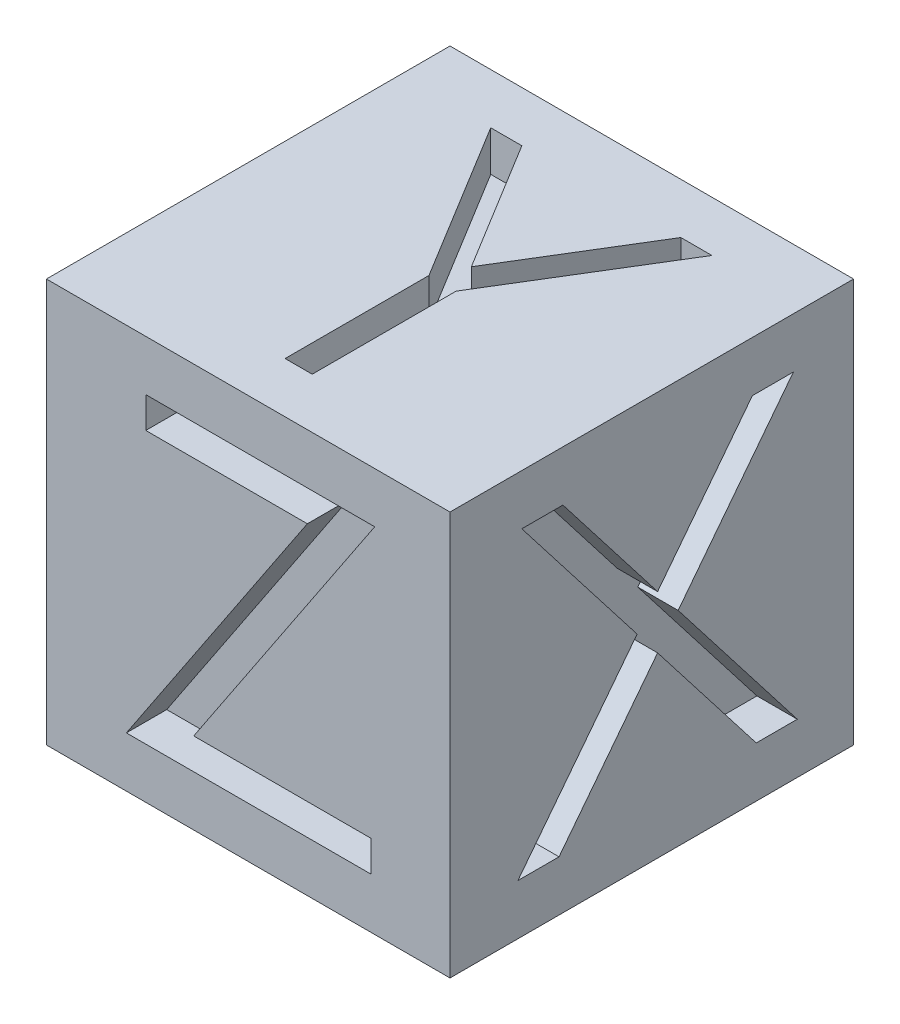
ISO-10303-21;
HEADER;
FILE_DESCRIPTION(('STEP AP214'),'2;1');
FILE_NAME('part.step','',(''),(''),'','','');
FILE_SCHEMA(('AUTOMOTIVE_DESIGN { 1 0 10303 214 1 1 1 1 }'));
ENDSEC;
DATA;
#1=APPLICATION_CONTEXT('core data for automotive mechanical design processes');
#2=APPLICATION_PROTOCOL_DEFINITION('international standard','automotive_design',2000,#1);
#3=PRODUCT_CONTEXT('',#1,'mechanical');
#4=PRODUCT('Part','Part','',(#3));
#5=PRODUCT_RELATED_PRODUCT_CATEGORY('part','',(#4));
#6=PRODUCT_DEFINITION_FORMATION('','',#4);
#7=PRODUCT_DEFINITION_CONTEXT('part definition',#1,'design');
#8=PRODUCT_DEFINITION('design','',#6,#7);
#9=PRODUCT_DEFINITION_SHAPE('','',#8);
#10=(LENGTH_UNIT() NAMED_UNIT(*) SI_UNIT(.MILLI.,.METRE.));
#11=(NAMED_UNIT(*) PLANE_ANGLE_UNIT() SI_UNIT($,.RADIAN.));
#12=(NAMED_UNIT(*) SI_UNIT($,.STERADIAN.) SOLID_ANGLE_UNIT());
#13=UNCERTAINTY_MEASURE_WITH_UNIT(LENGTH_MEASURE(1.E-05),#10,'distance_accuracy_value','');
#14=(GEOMETRIC_REPRESENTATION_CONTEXT(3) GLOBAL_UNCERTAINTY_ASSIGNED_CONTEXT((#13)) GLOBAL_UNIT_ASSIGNED_CONTEXT((#10,
#11,#12)) REPRESENTATION_CONTEXT('',''));
#15=CARTESIAN_POINT('',(0.,0.,0.));
#16=DIRECTION('',(0.,0.,1.));
#17=DIRECTION('',(1.,0.,0.));
#18=AXIS2_PLACEMENT_3D('',#15,#16,#17);
#19=CARTESIAN_POINT('',(0.,20.,0.));
#20=DIRECTION('',(0.,1.,0.));
#21=DIRECTION('',(0.,0.,1.));
#22=AXIS2_PLACEMENT_3D('',#19,#20,#21);
#23=PLANE('',#22);
#24=DIRECTION('',(0.,0.,1.));
#25=VECTOR('',#24,1.);
#26=CARTESIAN_POINT('',(-10.,20.,10.));
#27=LINE('',#26,#25);
#28=CARTESIAN_POINT('',(-10.,20.,-10.));
#29=VERTEX_POINT('',#28);
#30=CARTESIAN_POINT('',(-10.,20.,10.));
#31=VERTEX_POINT('',#30);
#32=EDGE_CURVE('E490',#29,#31,#27,.T.);
#33=ORIENTED_EDGE('',*,*,#32,.T.);
#34=DIRECTION('',(1.,0.,0.));
#35=VECTOR('',#34,1.);
#36=CARTESIAN_POINT('',(10.,20.,10.));
#37=LINE('',#36,#35);
#38=CARTESIAN_POINT('',(10.,20.,10.));
#39=VERTEX_POINT('',#38);
#40=EDGE_CURVE('E494',#31,#39,#37,.T.);
#41=ORIENTED_EDGE('',*,*,#40,.T.);
#42=DIRECTION('',(0.,0.,-1.));
#43=VECTOR('',#42,1.);
#44=CARTESIAN_POINT('',(10.,20.,10.));
#45=LINE('',#44,#43);
#46=CARTESIAN_POINT('',(10.,20.,-10.));
#47=VERTEX_POINT('',#46);
#48=EDGE_CURVE('E498',#39,#47,#45,.T.);
#49=ORIENTED_EDGE('',*,*,#48,.T.);
#50=DIRECTION('',(-1.,0.,0.));
#51=VECTOR('',#50,1.);
#52=CARTESIAN_POINT('',(10.,20.,-10.));
#53=LINE('',#52,#51);
#54=EDGE_CURVE('E501',#47,#29,#53,.T.);
#55=ORIENTED_EDGE('',*,*,#54,.T.);
#56=EDGE_LOOP('',(#33,#41,#49,#55));
#57=FACE_BOUND('',#56,.T.);
#58=DIRECTION('',(0.,0.,-1.));
#59=VECTOR('',#58,1.);
#60=CARTESIAN_POINT('',(-0.673076923076924,20.,7.5));
#61=LINE('',#60,#59);
#62=CARTESIAN_POINT('',(-0.673076923076924,20.,7.5));
#63=VERTEX_POINT('',#62);
#64=CARTESIAN_POINT('',(-0.673076923076924,20.,0.369591346153846));
#65=VERTEX_POINT('',#64);
#66=EDGE_CURVE('E274',#63,#65,#61,.T.);
#67=ORIENTED_EDGE('',*,*,#66,.T.);
#68=DIRECTION('',(-0.521331386880887,0.,-0.853354313900651));
#69=VECTOR('',#68,1.);
#70=CARTESIAN_POINT('',(-0.673076923076924,20.,0.369591346153846));
#71=LINE('',#70,#69);
#72=CARTESIAN_POINT('',(-5.48076923076923,20.,-7.5));
#73=VERTEX_POINT('',#72);
#74=EDGE_CURVE('E54',#65,#73,#71,.T.);
#75=ORIENTED_EDGE('',*,*,#74,.T.);
#76=DIRECTION('',(1.,0.,0.));
#77=VECTOR('',#76,1.);
#78=CARTESIAN_POINT('',(-5.48076923076923,20.,-7.5));
#79=LINE('',#78,#77);
#80=CARTESIAN_POINT('',(-3.93930288461539,20.,-7.5));
#81=VERTEX_POINT('',#80);
#82=EDGE_CURVE('E278',#73,#81,#79,.T.);
#83=ORIENTED_EDGE('',*,*,#82,.T.);
#84=DIRECTION('',(0.521787793651245,0.,0.853075318126463));
#85=VECTOR('',#84,1.);
#86=CARTESIAN_POINT('',(-3.93930288461539,20.,-7.5));
#87=LINE('',#86,#85);
#88=CARTESIAN_POINT('',(0.00300480769230716,20.,-1.0546875));
#89=VERTEX_POINT('',#88);
#90=EDGE_CURVE('E969',#81,#89,#87,.T.);
#91=ORIENTED_EDGE('',*,*,#90,.T.);
#92=DIRECTION('',(0.521208584832579,0.,-0.853429324019757));
#93=VECTOR('',#92,1.);
#94=CARTESIAN_POINT('',(0.00300480769230716,20.,-1.0546875));
#95=LINE('',#94,#93);
#96=CARTESIAN_POINT('',(3.93930288461539,20.,-7.5));
#97=VERTEX_POINT('',#96);
#98=EDGE_CURVE('E971',#89,#97,#95,.T.);
#99=ORIENTED_EDGE('',*,*,#98,.T.);
#100=DIRECTION('',(1.,0.,0.));
#101=VECTOR('',#100,1.);
#102=CARTESIAN_POINT('',(3.93930288461539,20.,-7.5));
#103=LINE('',#102,#101);
#104=CARTESIAN_POINT('',(5.48076923076923,20.,-7.5));
#105=VERTEX_POINT('',#104);
#106=EDGE_CURVE('E976',#97,#105,#103,.T.);
#107=ORIENTED_EDGE('',*,*,#106,.T.);
#108=DIRECTION('',(-0.521331386880887,0.,0.853354313900651));
#109=VECTOR('',#108,1.);
#110=CARTESIAN_POINT('',(5.48076923076923,20.,-7.5));
#111=LINE('',#110,#109);
#112=CARTESIAN_POINT('',(0.673076923076923,20.,0.369591346153846));
#113=VERTEX_POINT('',#112);
#114=EDGE_CURVE('E944',#105,#113,#111,.T.);
#115=ORIENTED_EDGE('',*,*,#114,.T.);
#116=DIRECTION('',(0.,0.,1.));
#117=VECTOR('',#116,1.);
#118=CARTESIAN_POINT('',(0.673076923076923,20.,0.369591346153846));
#119=LINE('',#118,#117);
#120=CARTESIAN_POINT('',(0.673076923076923,20.,7.5));
#121=VERTEX_POINT('',#120);
#122=EDGE_CURVE('E939',#113,#121,#119,.T.);
#123=ORIENTED_EDGE('',*,*,#122,.T.);
#124=DIRECTION('',(-1.,0.,0.));
#125=VECTOR('',#124,1.);
#126=CARTESIAN_POINT('',(0.673076923076923,20.,7.5));
#127=LINE('',#126,#125);
#128=EDGE_CURVE('E933',#121,#63,#127,.T.);
#129=ORIENTED_EDGE('',*,*,#128,.T.);
#130=EDGE_LOOP('',(#67,#75,#83,#91,#99,#107,#115,#123,#129));
#131=FACE_BOUND('',#130,.T.);
#132=ADVANCED_FACE('F38',(#57,#131),#23,.T.);
#133=CARTESIAN_POINT('',(10.,20.,10.));
#134=DIRECTION('',(-1.,0.,0.));
#135=DIRECTION('',(0.,0.,1.));
#136=AXIS2_PLACEMENT_3D('',#133,#134,#135);
#137=PLANE('',#136);
#138=DIRECTION('',(0.,0.,-1.));
#139=VECTOR('',#138,1.);
#140=CARTESIAN_POINT('',(10.,0.,10.));
#141=LINE('',#140,#139);
#142=CARTESIAN_POINT('',(10.,0.,10.));
#143=VERTEX_POINT('',#142);
#144=CARTESIAN_POINT('',(10.,0.,-10.));
#145=VERTEX_POINT('',#144);
#146=EDGE_CURVE('E511',#143,#145,#141,.T.);
#147=ORIENTED_EDGE('',*,*,#146,.T.);
#148=DIRECTION('',(0.,-1.,0.));
#149=VECTOR('',#148,1.);
#150=CARTESIAN_POINT('',(10.,20.,-10.));
#151=LINE('',#150,#149);
#152=EDGE_CURVE('E519',#47,#145,#151,.T.);
#153=ORIENTED_EDGE('',*,*,#152,.F.);
#154=ORIENTED_EDGE('',*,*,#48,.F.);
#155=DIRECTION('',(0.,-1.,0.));
#156=VECTOR('',#155,1.);
#157=CARTESIAN_POINT('',(10.,20.,10.));
#158=LINE('',#157,#156);
#159=EDGE_CURVE('E47',#39,#143,#158,.T.);
#160=ORIENTED_EDGE('',*,*,#159,.T.);
#161=EDGE_LOOP('',(#147,#153,#154,#160));
#162=FACE_BOUND('',#161,.T.);
#163=DIRECTION('',(0.,0.790512484886621,0.612445925154523));
#164=VECTOR('',#163,1.);
#165=CARTESIAN_POINT('',(10.,10.1231971153846,0.727163461538461));
#166=LINE('',#165,#164);
#167=CARTESIAN_POINT('',(10.,10.1231971153846,0.727163461538462));
#168=VERTEX_POINT('',#167);
#169=CARTESIAN_POINT('',(10.,17.5,6.44230769230769));
#170=VERTEX_POINT('',#169);
#171=EDGE_CURVE('E62',#168,#170,#166,.T.);
#172=ORIENTED_EDGE('',*,*,#171,.T.);
#173=DIRECTION('',(0.,0.,-1.));
#174=VECTOR('',#173,1.);
#175=CARTESIAN_POINT('',(10.,17.5,6.44230769230769));
#176=LINE('',#175,#174);
#177=CARTESIAN_POINT('',(10.,17.5,4.40504807692308));
#178=VERTEX_POINT('',#177);
#179=EDGE_CURVE('E284',#170,#178,#176,.T.);
#180=ORIENTED_EDGE('',*,*,#179,.T.);
#181=DIRECTION('',(0.,-0.790638008474675,-0.612283871709193));
#182=VECTOR('',#181,1.);
#183=CARTESIAN_POINT('',(10.,17.5,4.40504807692308));
#184=LINE('',#183,#182);
#185=CARTESIAN_POINT('',(10.,11.4393028846154,-0.288461538461539));
#186=VERTEX_POINT('',#185);
#187=EDGE_CURVE('E332',#178,#186,#184,.T.);
#188=ORIENTED_EDGE('',*,*,#187,.T.);
#189=DIRECTION('',(0.,0.790448257101086,-0.612528817971739));
#190=VECTOR('',#189,1.);
#191=CARTESIAN_POINT('',(10.,11.4393028846154,-0.288461538461539));
#192=LINE('',#191,#190);
#193=CARTESIAN_POINT('',(10.,17.5,-4.98497596153846));
#194=VERTEX_POINT('',#193);
#195=EDGE_CURVE('E336',#186,#194,#192,.T.);
#196=ORIENTED_EDGE('',*,*,#195,.T.);
#197=DIRECTION('',(0.,0.,-1.));
#198=VECTOR('',#197,1.);
#199=CARTESIAN_POINT('',(10.,17.5,-4.98497596153846));
#200=LINE('',#199,#198);
#201=CARTESIAN_POINT('',(10.,17.5,-7.01923076923077));
#202=VERTEX_POINT('',#201);
#203=EDGE_CURVE('E340',#194,#202,#200,.T.);
#204=ORIENTED_EDGE('',*,*,#203,.T.);
#205=DIRECTION('',(0.,-0.790668385561736,0.612244643972652));
#206=VECTOR('',#205,1.);
#207=CARTESIAN_POINT('',(10.,17.5,-7.01923076923077));
#208=LINE('',#207,#206);
#209=CARTESIAN_POINT('',(10.,10.1231971153846,-1.30709134615385));
#210=VERTEX_POINT('',#209);
#211=EDGE_CURVE('E344',#202,#210,#208,.T.);
#212=ORIENTED_EDGE('',*,*,#211,.T.);
#213=DIRECTION('',(0.,-0.790592308194247,-0.612342879622269));
#214=VECTOR('',#213,1.);
#215=CARTESIAN_POINT('',(10.,10.1231971153846,-1.30709134615385));
#216=LINE('',#215,#214);
#217=CARTESIAN_POINT('',(10.,2.5,-7.21153846153846));
#218=VERTEX_POINT('',#217);
#219=EDGE_CURVE('E348',#210,#218,#216,.T.);
#220=ORIENTED_EDGE('',*,*,#219,.T.);
#221=DIRECTION('',(0.,0.,1.));
#222=VECTOR('',#221,1.);
#223=CARTESIAN_POINT('',(10.,2.5,-7.21153846153846));
#224=LINE('',#223,#222);
#225=CARTESIAN_POINT('',(10.,2.5,-5.17728365384615));
#226=VERTEX_POINT('',#225);
#227=EDGE_CURVE('E352',#218,#226,#224,.T.);
#228=ORIENTED_EDGE('',*,*,#227,.T.);
#229=DIRECTION('',(0.,0.790506174837041,0.612454069742793));
#230=VECTOR('',#229,1.);
#231=CARTESIAN_POINT('',(10.,2.5,-5.17728365384615));
#232=LINE('',#231,#230);
#233=CARTESIAN_POINT('',(10.,8.81009615384616,-0.288461538461539));
#234=VERTEX_POINT('',#233);
#235=EDGE_CURVE('E356',#226,#234,#232,.T.);
#236=ORIENTED_EDGE('',*,*,#235,.T.);
#237=DIRECTION('',(0.,-0.790688430676369,0.612218756323703));
#238=VECTOR('',#237,1.);
#239=CARTESIAN_POINT('',(10.,8.81009615384616,-0.288461538461539));
#240=LINE('',#239,#238);
#241=CARTESIAN_POINT('',(10.,2.5,4.59735576923077));
#242=VERTEX_POINT('',#241);
#243=EDGE_CURVE('E360',#234,#242,#240,.T.);
#244=ORIENTED_EDGE('',*,*,#243,.T.);
#245=DIRECTION('',(0.,0.,1.));
#246=VECTOR('',#245,1.);
#247=CARTESIAN_POINT('',(10.,2.5,4.59735576923077));
#248=LINE('',#247,#246);
#249=CARTESIAN_POINT('',(10.,2.5,6.63461538461539));
#250=VERTEX_POINT('',#249);
#251=EDGE_CURVE('E364',#242,#250,#248,.T.);
#252=ORIENTED_EDGE('',*,*,#251,.T.);
#253=DIRECTION('',(0.,0.790441451165735,-0.612537600706281));
#254=VECTOR('',#253,1.);
#255=CARTESIAN_POINT('',(10.,2.5,6.63461538461539));
#256=LINE('',#255,#254);
#257=EDGE_CURVE('E295',#250,#168,#256,.T.);
#258=ORIENTED_EDGE('',*,*,#257,.T.);
#259=EDGE_LOOP('',(#172,#180,#188,#196,#204,#212,#220,#228,#236,#244,#252,#258));
#260=FACE_BOUND('',#259,.T.);
#261=ADVANCED_FACE('F528',(#162,#260),#137,.F.);
#262=CARTESIAN_POINT('',(10.,20.,10.));
#263=DIRECTION('',(0.,0.,-1.));
#264=DIRECTION('',(-1.,0.,0.));
#265=AXIS2_PLACEMENT_3D('',#262,#263,#264);
#266=PLANE('',#265);
#267=DIRECTION('',(1.,0.,0.));
#268=VECTOR('',#267,1.);
#269=CARTESIAN_POINT('',(10.,0.,10.));
#270=LINE('',#269,#268);
#271=CARTESIAN_POINT('',(-10.,0.,10.));
#272=VERTEX_POINT('',#271);
#273=EDGE_CURVE('E508',#272,#143,#270,.T.);
#274=ORIENTED_EDGE('',*,*,#273,.T.);
#275=ORIENTED_EDGE('',*,*,#159,.F.);
#276=ORIENTED_EDGE('',*,*,#40,.F.);
#277=DIRECTION('',(0.,-1.,0.));
#278=VECTOR('',#277,1.);
#279=CARTESIAN_POINT('',(-10.,20.,10.));
#280=LINE('',#279,#278);
#281=EDGE_CURVE('E11',#31,#272,#280,.T.);
#282=ORIENTED_EDGE('',*,*,#281,.T.);
#283=EDGE_LOOP('',(#274,#275,#276,#282));
#284=FACE_BOUND('',#283,.T.);
#285=DIRECTION('',(-1.,0.,0.));
#286=VECTOR('',#285,1.);
#287=CARTESIAN_POINT('',(2.93088942307692,15.9615384615385,10.));
#288=LINE('',#287,#286);
#289=CARTESIAN_POINT('',(2.93088942307692,15.9615384615385,10.));
#290=VERTEX_POINT('',#289);
#291=CARTESIAN_POINT('',(-5.07692307692308,15.9615384615385,10.));
#292=VERTEX_POINT('',#291);
#293=EDGE_CURVE('E406',#290,#292,#288,.T.);
#294=ORIENTED_EDGE('',*,*,#293,.T.);
#295=DIRECTION('',(0.,1.,0.));
#296=VECTOR('',#295,1.);
#297=CARTESIAN_POINT('',(-5.07692307692308,15.9615384615385,10.));
#298=LINE('',#297,#296);
#299=CARTESIAN_POINT('',(-5.07692307692308,17.5,10.));
#300=VERTEX_POINT('',#299);
#301=EDGE_CURVE('E437',#292,#300,#298,.T.);
#302=ORIENTED_EDGE('',*,*,#301,.T.);
#303=DIRECTION('',(1.,0.,0.));
#304=VECTOR('',#303,1.);
#305=CARTESIAN_POINT('',(-5.07692307692308,17.5,10.));
#306=LINE('',#305,#304);
#307=CARTESIAN_POINT('',(6.26923076923077,17.5,10.));
#308=VERTEX_POINT('',#307);
#309=EDGE_CURVE('E441',#300,#308,#306,.T.);
#310=ORIENTED_EDGE('',*,*,#309,.T.);
#311=DIRECTION('',(-0.55448584235818,-0.832193157040083,0.));
#312=VECTOR('',#311,1.);
#313=CARTESIAN_POINT('',(6.26923076923077,17.5,10.));
#314=LINE('',#313,#312);
#315=CARTESIAN_POINT('',(-2.70012019230769,4.03846153846154,10.));
#316=VERTEX_POINT('',#315);
#317=EDGE_CURVE('E445',#308,#316,#314,.T.);
#318=ORIENTED_EDGE('',*,*,#317,.T.);
#319=DIRECTION('',(1.,0.,0.));
#320=VECTOR('',#319,1.);
#321=CARTESIAN_POINT('',(-2.70012019230769,4.03846153846154,10.));
#322=LINE('',#321,#320);
#323=CARTESIAN_POINT('',(6.07692307692308,4.03846153846154,10.));
#324=VERTEX_POINT('',#323);
#325=EDGE_CURVE('E449',#316,#324,#322,.T.);
#326=ORIENTED_EDGE('',*,*,#325,.T.);
#327=DIRECTION('',(0.,-1.,0.));
#328=VECTOR('',#327,1.);
#329=CARTESIAN_POINT('',(6.07692307692308,4.03846153846154,10.));
#330=LINE('',#329,#328);
#331=CARTESIAN_POINT('',(6.07692307692308,2.5,10.));
#332=VERTEX_POINT('',#331);
#333=EDGE_CURVE('E453',#324,#332,#330,.T.);
#334=ORIENTED_EDGE('',*,*,#333,.T.);
#335=DIRECTION('',(-1.,0.,0.));
#336=VECTOR('',#335,1.);
#337=CARTESIAN_POINT('',(6.07692307692308,2.5,10.));
#338=LINE('',#337,#336);
#339=CARTESIAN_POINT('',(-6.03846153846154,2.5,10.));
#340=VERTEX_POINT('',#339);
#341=EDGE_CURVE('E457',#332,#340,#338,.T.);
#342=ORIENTED_EDGE('',*,*,#341,.T.);
#343=DIRECTION('',(0.55448584235818,0.832193157040083,0.));
#344=VECTOR('',#343,1.);
#345=CARTESIAN_POINT('',(-6.03846153846154,2.5,10.));
#346=LINE('',#345,#344);
#347=EDGE_CURVE('E412',#340,#290,#346,.T.);
#348=ORIENTED_EDGE('',*,*,#347,.T.);
#349=EDGE_LOOP('',(#294,#302,#310,#318,#326,#334,#342,#348));
#350=FACE_BOUND('',#349,.T.);
#351=ADVANCED_FACE('F545',(#284,#350),#266,.F.);
#352=CARTESIAN_POINT('',(-10.,20.,10.));
#353=DIRECTION('',(1.,0.,0.));
#354=DIRECTION('',(0.,0.,-1.));
#355=AXIS2_PLACEMENT_3D('',#352,#353,#354);
#356=PLANE('',#355);
#357=DIRECTION('',(0.,0.,1.));
#358=VECTOR('',#357,1.);
#359=CARTESIAN_POINT('',(-10.,0.,10.));
#360=LINE('',#359,#358);
#361=CARTESIAN_POINT('',(-10.,0.,-10.));
#362=VERTEX_POINT('',#361);
#363=EDGE_CURVE('E489',#362,#272,#360,.T.);
#364=ORIENTED_EDGE('',*,*,#363,.T.);
#365=ORIENTED_EDGE('',*,*,#281,.F.);
#366=ORIENTED_EDGE('',*,*,#32,.F.);
#367=DIRECTION('',(0.,-1.,0.));
#368=VECTOR('',#367,1.);
#369=CARTESIAN_POINT('',(-10.,20.,-10.));
#370=LINE('',#369,#368);
#371=EDGE_CURVE('E504',#29,#362,#370,.T.);
#372=ORIENTED_EDGE('',*,*,#371,.T.);
#373=EDGE_LOOP('',(#364,#365,#366,#372));
#374=FACE_BOUND('',#373,.T.);
#375=ADVANCED_FACE('F40',(#374),#356,.F.);
#376=CARTESIAN_POINT('',(10.,20.,-10.));
#377=DIRECTION('',(0.,0.,1.));
#378=DIRECTION('',(1.,0.,0.));
#379=AXIS2_PLACEMENT_3D('',#376,#377,#378);
#380=PLANE('',#379);
#381=DIRECTION('',(-1.,0.,0.));
#382=VECTOR('',#381,1.);
#383=CARTESIAN_POINT('',(10.,0.,-10.));
#384=LINE('',#383,#382);
#385=EDGE_CURVE('E495',#145,#362,#384,.T.);
#386=ORIENTED_EDGE('',*,*,#385,.T.);
#387=ORIENTED_EDGE('',*,*,#371,.F.);
#388=ORIENTED_EDGE('',*,*,#54,.F.);
#389=ORIENTED_EDGE('',*,*,#152,.T.);
#390=EDGE_LOOP('',(#386,#387,#388,#389));
#391=FACE_BOUND('',#390,.T.);
#392=ADVANCED_FACE('F538',(#391),#380,.F.);
#393=CARTESIAN_POINT('',(0.,0.,0.));
#394=DIRECTION('',(0.,1.,0.));
#395=DIRECTION('',(0.,0.,1.));
#396=AXIS2_PLACEMENT_3D('',#393,#394,#395);
#397=PLANE('',#396);
#398=ORIENTED_EDGE('',*,*,#363,.F.);
#399=ORIENTED_EDGE('',*,*,#385,.F.);
#400=ORIENTED_EDGE('',*,*,#146,.F.);
#401=ORIENTED_EDGE('',*,*,#273,.F.);
#402=EDGE_LOOP('',(#398,#399,#400,#401));
#403=FACE_BOUND('',#402,.T.);
#404=ADVANCED_FACE('F535',(#403),#397,.F.);
#405=CARTESIAN_POINT('',(2.93088942307692,15.9615384615385,8.00000000000003));
#406=DIRECTION('',(0.,1.,0.));
#407=DIRECTION('',(0.,0.,1.));
#408=AXIS2_PLACEMENT_3D('',#405,#406,#407);
#409=PLANE('',#408);
#410=ORIENTED_EDGE('',*,*,#293,.F.);
#411=DIRECTION('',(0.,0.,1.));
#412=VECTOR('',#411,1.);
#413=CARTESIAN_POINT('',(2.93088942307692,15.9615384615385,8.00000000000003));
#414=LINE('',#413,#412);
#415=CARTESIAN_POINT('',(2.93088942307692,15.9615384615385,8.00000000000003));
#416=VERTEX_POINT('',#415);
#417=EDGE_CURVE('E433',#416,#290,#414,.T.);
#418=ORIENTED_EDGE('',*,*,#417,.F.);
#419=DIRECTION('',(-1.,0.,0.));
#420=VECTOR('',#419,1.);
#421=CARTESIAN_POINT('',(2.93088942307692,15.9615384615385,8.00000000000003));
#422=LINE('',#421,#420);
#423=CARTESIAN_POINT('',(-5.07692307692308,15.9615384615385,8.00000000000003));
#424=VERTEX_POINT('',#423);
#425=EDGE_CURVE('E407',#416,#424,#422,.T.);
#426=ORIENTED_EDGE('',*,*,#425,.T.);
#427=DIRECTION('',(0.,0.,1.));
#428=VECTOR('',#427,1.);
#429=CARTESIAN_POINT('',(-5.07692307692308,15.9615384615385,8.00000000000003));
#430=LINE('',#429,#428);
#431=EDGE_CURVE('E485',#424,#292,#430,.T.);
#432=ORIENTED_EDGE('',*,*,#431,.T.);
#433=EDGE_LOOP('',(#410,#418,#426,#432));
#434=FACE_BOUND('',#433,.T.);
#435=ADVANCED_FACE('F551',(#434),#409,.T.);
#436=CARTESIAN_POINT('',(-5.07692307692308,15.9615384615385,8.00000000000003));
#437=DIRECTION('',(1.,0.,0.));
#438=DIRECTION('',(0.,0.,-1.));
#439=AXIS2_PLACEMENT_3D('',#436,#437,#438);
#440=PLANE('',#439);
#441=ORIENTED_EDGE('',*,*,#301,.F.);
#442=ORIENTED_EDGE('',*,*,#431,.F.);
#443=DIRECTION('',(0.,1.,0.));
#444=VECTOR('',#443,1.);
#445=CARTESIAN_POINT('',(-5.07692307692308,15.9615384615385,8.00000000000003));
#446=LINE('',#445,#444);
#447=CARTESIAN_POINT('',(-5.07692307692308,17.5,8.00000000000003));
#448=VERTEX_POINT('',#447);
#449=EDGE_CURVE('E411',#424,#448,#446,.T.);
#450=ORIENTED_EDGE('',*,*,#449,.T.);
#451=DIRECTION('',(0.,0.,1.));
#452=VECTOR('',#451,1.);
#453=CARTESIAN_POINT('',(-5.07692307692308,17.5,8.00000000000003));
#454=LINE('',#453,#452);
#455=EDGE_CURVE('E482',#448,#300,#454,.T.);
#456=ORIENTED_EDGE('',*,*,#455,.T.);
#457=EDGE_LOOP('',(#441,#442,#450,#456));
#458=FACE_BOUND('',#457,.T.);
#459=ADVANCED_FACE('F564',(#458),#440,.T.);
#460=CARTESIAN_POINT('',(-5.07692307692308,17.5,8.00000000000003));
#461=DIRECTION('',(0.,-1.,0.));
#462=DIRECTION('',(0.,0.,-1.));
#463=AXIS2_PLACEMENT_3D('',#460,#461,#462);
#464=PLANE('',#463);
#465=ORIENTED_EDGE('',*,*,#309,.F.);
#466=ORIENTED_EDGE('',*,*,#455,.F.);
#467=DIRECTION('',(1.,0.,0.));
#468=VECTOR('',#467,1.);
#469=CARTESIAN_POINT('',(-5.07692307692308,17.5,8.00000000000003));
#470=LINE('',#469,#468);
#471=CARTESIAN_POINT('',(6.26923076923077,17.5,8.00000000000003));
#472=VERTEX_POINT('',#471);
#473=EDGE_CURVE('E415',#448,#472,#470,.T.);
#474=ORIENTED_EDGE('',*,*,#473,.T.);
#475=DIRECTION('',(0.,0.,1.));
#476=VECTOR('',#475,1.);
#477=CARTESIAN_POINT('',(6.26923076923077,17.5,8.00000000000003));
#478=LINE('',#477,#476);
#479=EDGE_CURVE('E479',#472,#308,#478,.T.);
#480=ORIENTED_EDGE('',*,*,#479,.T.);
#481=EDGE_LOOP('',(#465,#466,#474,#480));
#482=FACE_BOUND('',#481,.T.);
#483=ADVANCED_FACE('F568',(#482),#464,.T.);
#484=CARTESIAN_POINT('',(6.26923076923077,17.5,8.00000000000003));
#485=DIRECTION('',(-0.832193157040083,0.55448584235818,0.));
#486=DIRECTION('',(-0.55448584235818,-0.832193157040083,0.));
#487=AXIS2_PLACEMENT_3D('',#484,#485,#486);
#488=PLANE('',#487);
#489=ORIENTED_EDGE('',*,*,#317,.F.);
#490=ORIENTED_EDGE('',*,*,#479,.F.);
#491=DIRECTION('',(-0.55448584235818,-0.832193157040083,0.));
#492=VECTOR('',#491,1.);
#493=CARTESIAN_POINT('',(6.26923076923077,17.5,8.00000000000003));
#494=LINE('',#493,#492);
#495=CARTESIAN_POINT('',(-2.70012019230769,4.03846153846154,8.00000000000003));
#496=VERTEX_POINT('',#495);
#497=EDGE_CURVE('E418',#472,#496,#494,.T.);
#498=ORIENTED_EDGE('',*,*,#497,.T.);
#499=DIRECTION('',(0.,0.,1.));
#500=VECTOR('',#499,1.);
#501=CARTESIAN_POINT('',(-2.70012019230769,4.03846153846154,8.00000000000003));
#502=LINE('',#501,#500);
#503=EDGE_CURVE('E476',#496,#316,#502,.T.);
#504=ORIENTED_EDGE('',*,*,#503,.T.);
#505=EDGE_LOOP('',(#489,#490,#498,#504));
#506=FACE_BOUND('',#505,.T.);
#507=ADVANCED_FACE('F573',(#506),#488,.T.);
#508=CARTESIAN_POINT('',(-2.70012019230769,4.03846153846154,8.00000000000003));
#509=DIRECTION('',(0.,-1.,0.));
#510=DIRECTION('',(0.,0.,-1.));
#511=AXIS2_PLACEMENT_3D('',#508,#509,#510);
#512=PLANE('',#511);
#513=ORIENTED_EDGE('',*,*,#325,.F.);
#514=ORIENTED_EDGE('',*,*,#503,.F.);
#515=DIRECTION('',(1.,0.,0.));
#516=VECTOR('',#515,1.);
#517=CARTESIAN_POINT('',(-2.70012019230769,4.03846153846154,8.00000000000003));
#518=LINE('',#517,#516);
#519=CARTESIAN_POINT('',(6.07692307692308,4.03846153846154,8.00000000000003));
#520=VERTEX_POINT('',#519);
#521=EDGE_CURVE('E421',#496,#520,#518,.T.);
#522=ORIENTED_EDGE('',*,*,#521,.T.);
#523=DIRECTION('',(0.,0.,1.));
#524=VECTOR('',#523,1.);
#525=CARTESIAN_POINT('',(6.07692307692308,4.03846153846154,8.00000000000003));
#526=LINE('',#525,#524);
#527=EDGE_CURVE('E473',#520,#324,#526,.T.);
#528=ORIENTED_EDGE('',*,*,#527,.T.);
#529=EDGE_LOOP('',(#513,#514,#522,#528));
#530=FACE_BOUND('',#529,.T.);
#531=ADVANCED_FACE('F578',(#530),#512,.T.);
#532=CARTESIAN_POINT('',(6.07692307692308,4.03846153846154,8.00000000000003));
#533=DIRECTION('',(-1.,0.,0.));
#534=DIRECTION('',(0.,0.,1.));
#535=AXIS2_PLACEMENT_3D('',#532,#533,#534);
#536=PLANE('',#535);
#537=ORIENTED_EDGE('',*,*,#333,.F.);
#538=ORIENTED_EDGE('',*,*,#527,.F.);
#539=DIRECTION('',(0.,-1.,0.));
#540=VECTOR('',#539,1.);
#541=CARTESIAN_POINT('',(6.07692307692308,4.03846153846154,8.00000000000003));
#542=LINE('',#541,#540);
#543=CARTESIAN_POINT('',(6.07692307692308,2.5,8.00000000000003));
#544=VERTEX_POINT('',#543);
#545=EDGE_CURVE('E424',#520,#544,#542,.T.);
#546=ORIENTED_EDGE('',*,*,#545,.T.);
#547=DIRECTION('',(0.,0.,1.));
#548=VECTOR('',#547,1.);
#549=CARTESIAN_POINT('',(6.07692307692308,2.5,8.00000000000003));
#550=LINE('',#549,#548);
#551=EDGE_CURVE('E470',#544,#332,#550,.T.);
#552=ORIENTED_EDGE('',*,*,#551,.T.);
#553=EDGE_LOOP('',(#537,#538,#546,#552));
#554=FACE_BOUND('',#553,.T.);
#555=ADVANCED_FACE('F582',(#554),#536,.T.);
#556=CARTESIAN_POINT('',(6.07692307692308,2.5,8.00000000000003));
#557=DIRECTION('',(0.,1.,0.));
#558=DIRECTION('',(0.,0.,1.));
#559=AXIS2_PLACEMENT_3D('',#556,#557,#558);
#560=PLANE('',#559);
#561=ORIENTED_EDGE('',*,*,#341,.F.);
#562=ORIENTED_EDGE('',*,*,#551,.F.);
#563=DIRECTION('',(-1.,0.,0.));
#564=VECTOR('',#563,1.);
#565=CARTESIAN_POINT('',(6.07692307692308,2.5,8.00000000000003));
#566=LINE('',#565,#564);
#567=CARTESIAN_POINT('',(-6.03846153846154,2.5,8.00000000000003));
#568=VERTEX_POINT('',#567);
#569=EDGE_CURVE('E427',#544,#568,#566,.T.);
#570=ORIENTED_EDGE('',*,*,#569,.T.);
#571=DIRECTION('',(0.,0.,1.));
#572=VECTOR('',#571,1.);
#573=CARTESIAN_POINT('',(-6.03846153846154,2.5,8.00000000000003));
#574=LINE('',#573,#572);
#575=EDGE_CURVE('E467',#568,#340,#574,.T.);
#576=ORIENTED_EDGE('',*,*,#575,.T.);
#577=EDGE_LOOP('',(#561,#562,#570,#576));
#578=FACE_BOUND('',#577,.T.);
#579=ADVANCED_FACE('F586',(#578),#560,.T.);
#580=CARTESIAN_POINT('',(-6.03846153846154,2.5,8.00000000000003));
#581=DIRECTION('',(0.832193157040083,-0.55448584235818,0.));
#582=DIRECTION('',(0.55448584235818,0.832193157040083,0.));
#583=AXIS2_PLACEMENT_3D('',#580,#581,#582);
#584=PLANE('',#583);
#585=ORIENTED_EDGE('',*,*,#347,.F.);
#586=ORIENTED_EDGE('',*,*,#575,.F.);
#587=DIRECTION('',(0.55448584235818,0.832193157040083,0.));
#588=VECTOR('',#587,1.);
#589=CARTESIAN_POINT('',(-6.03846153846154,2.5,8.00000000000003));
#590=LINE('',#589,#588);
#591=EDGE_CURVE('E430',#568,#416,#590,.T.);
#592=ORIENTED_EDGE('',*,*,#591,.T.);
#593=ORIENTED_EDGE('',*,*,#417,.T.);
#594=EDGE_LOOP('',(#585,#586,#592,#593));
#595=FACE_BOUND('',#594,.T.);
#596=ADVANCED_FACE('F555',(#595),#584,.T.);
#597=CARTESIAN_POINT('',(0.,0.,8.00000000000003));
#598=DIRECTION('',(0.,0.,-1.));
#599=DIRECTION('',(-1.,0.,0.));
#600=AXIS2_PLACEMENT_3D('',#597,#598,#599);
#601=PLANE('',#600);
#602=ORIENTED_EDGE('',*,*,#425,.F.);
#603=ORIENTED_EDGE('',*,*,#591,.F.);
#604=ORIENTED_EDGE('',*,*,#569,.F.);
#605=ORIENTED_EDGE('',*,*,#545,.F.);
#606=ORIENTED_EDGE('',*,*,#521,.F.);
#607=ORIENTED_EDGE('',*,*,#497,.F.);
#608=ORIENTED_EDGE('',*,*,#473,.F.);
#609=ORIENTED_EDGE('',*,*,#449,.F.);
#610=EDGE_LOOP('',(#602,#603,#604,#605,#606,#607,#608,#609));
#611=FACE_BOUND('',#610,.T.);
#612=ADVANCED_FACE('F560',(#611),#601,.F.);
#613=CARTESIAN_POINT('',(8.,10.1231971153846,0.727163461538461));
#614=DIRECTION('',(0.,0.612445925154523,-0.790512484886621));
#615=DIRECTION('',(0.,0.790512484886621,0.612445925154523));
#616=AXIS2_PLACEMENT_3D('',#613,#614,#615);
#617=PLANE('',#616);
#618=ORIENTED_EDGE('',*,*,#171,.F.);
#619=DIRECTION('',(1.,0.,0.));
#620=VECTOR('',#619,1.);
#621=CARTESIAN_POINT('',(8.,10.1231971153846,0.727163461538461));
#622=LINE('',#621,#620);
#623=CARTESIAN_POINT('',(8.,10.1231971153846,0.727163461538461));
#624=VERTEX_POINT('',#623);
#625=EDGE_CURVE('E327',#624,#168,#622,.T.);
#626=ORIENTED_EDGE('',*,*,#625,.F.);
#627=DIRECTION('',(0.,0.790512484886621,0.612445925154523));
#628=VECTOR('',#627,1.);
#629=CARTESIAN_POINT('',(8.,10.1231971153846,0.727163461538461));
#630=LINE('',#629,#628);
#631=CARTESIAN_POINT('',(8.,17.5,6.44230769230769));
#632=VERTEX_POINT('',#631);
#633=EDGE_CURVE('E290',#624,#632,#630,.T.);
#634=ORIENTED_EDGE('',*,*,#633,.T.);
#635=DIRECTION('',(1.,0.,0.));
#636=VECTOR('',#635,1.);
#637=CARTESIAN_POINT('',(8.,17.5,6.44230769230769));
#638=LINE('',#637,#636);
#639=EDGE_CURVE('E403',#632,#170,#638,.T.);
#640=ORIENTED_EDGE('',*,*,#639,.T.);
#641=EDGE_LOOP('',(#618,#626,#634,#640));
#642=FACE_BOUND('',#641,.T.);
#643=ADVANCED_FACE('F635',(#642),#617,.T.);
#644=CARTESIAN_POINT('',(8.,17.5,6.44230769230769));
#645=DIRECTION('',(0.,-1.,0.));
#646=DIRECTION('',(0.,0.,-1.));
#647=AXIS2_PLACEMENT_3D('',#644,#645,#646);
#648=PLANE('',#647);
#649=ORIENTED_EDGE('',*,*,#179,.F.);
#650=ORIENTED_EDGE('',*,*,#639,.F.);
#651=DIRECTION('',(0.,0.,-1.));
#652=VECTOR('',#651,1.);
#653=CARTESIAN_POINT('',(8.,17.5,6.44230769230769));
#654=LINE('',#653,#652);
#655=CARTESIAN_POINT('',(8.,17.5,4.40504807692308));
#656=VERTEX_POINT('',#655);
#657=EDGE_CURVE('E294',#632,#656,#654,.T.);
#658=ORIENTED_EDGE('',*,*,#657,.T.);
#659=DIRECTION('',(1.,0.,0.));
#660=VECTOR('',#659,1.);
#661=CARTESIAN_POINT('',(8.,17.5,4.40504807692308));
#662=LINE('',#661,#660);
#663=EDGE_CURVE('E400',#656,#178,#662,.T.);
#664=ORIENTED_EDGE('',*,*,#663,.T.);
#665=EDGE_LOOP('',(#649,#650,#658,#664));
#666=FACE_BOUND('',#665,.T.);
#667=ADVANCED_FACE('F639',(#666),#648,.T.);
#668=CARTESIAN_POINT('',(8.,17.5,4.40504807692308));
#669=DIRECTION('',(0.,-0.612283871709193,0.790638008474675));
#670=DIRECTION('',(0.,-0.790638008474675,-0.612283871709193));
#671=AXIS2_PLACEMENT_3D('',#668,#669,#670);
#672=PLANE('',#671);
#673=ORIENTED_EDGE('',*,*,#187,.F.);
#674=ORIENTED_EDGE('',*,*,#663,.F.);
#675=DIRECTION('',(0.,-0.790638008474675,-0.612283871709193));
#676=VECTOR('',#675,1.);
#677=CARTESIAN_POINT('',(8.,17.5,4.40504807692308));
#678=LINE('',#677,#676);
#679=CARTESIAN_POINT('',(8.,11.4393028846154,-0.288461538461539));
#680=VERTEX_POINT('',#679);
#681=EDGE_CURVE('E298',#656,#680,#678,.T.);
#682=ORIENTED_EDGE('',*,*,#681,.T.);
#683=DIRECTION('',(1.,0.,0.));
#684=VECTOR('',#683,1.);
#685=CARTESIAN_POINT('',(8.,11.4393028846154,-0.288461538461539));
#686=LINE('',#685,#684);
#687=EDGE_CURVE('E397',#680,#186,#686,.T.);
#688=ORIENTED_EDGE('',*,*,#687,.T.);
#689=EDGE_LOOP('',(#673,#674,#682,#688));
#690=FACE_BOUND('',#689,.T.);
#691=ADVANCED_FACE('F648',(#690),#672,.T.);
#692=CARTESIAN_POINT('',(8.,11.4393028846154,-0.288461538461539));
#693=DIRECTION('',(0.,-0.612528817971739,-0.790448257101086));
#694=DIRECTION('',(0.,0.790448257101086,-0.612528817971739));
#695=AXIS2_PLACEMENT_3D('',#692,#693,#694);
#696=PLANE('',#695);
#697=ORIENTED_EDGE('',*,*,#195,.F.);
#698=ORIENTED_EDGE('',*,*,#687,.F.);
#699=DIRECTION('',(0.,0.790448257101086,-0.612528817971739));
#700=VECTOR('',#699,1.);
#701=CARTESIAN_POINT('',(8.,11.4393028846154,-0.288461538461539));
#702=LINE('',#701,#700);
#703=CARTESIAN_POINT('',(8.,17.5,-4.98497596153846));
#704=VERTEX_POINT('',#703);
#705=EDGE_CURVE('E301',#680,#704,#702,.T.);
#706=ORIENTED_EDGE('',*,*,#705,.T.);
#707=DIRECTION('',(1.,0.,0.));
#708=VECTOR('',#707,1.);
#709=CARTESIAN_POINT('',(8.,17.5,-4.98497596153846));
#710=LINE('',#709,#708);
#711=EDGE_CURVE('E394',#704,#194,#710,.T.);
#712=ORIENTED_EDGE('',*,*,#711,.T.);
#713=EDGE_LOOP('',(#697,#698,#706,#712));
#714=FACE_BOUND('',#713,.T.);
#715=ADVANCED_FACE('F658',(#714),#696,.T.);
#716=CARTESIAN_POINT('',(8.,17.5,-4.98497596153846));
#717=DIRECTION('',(0.,-1.,0.));
#718=DIRECTION('',(0.,0.,-1.));
#719=AXIS2_PLACEMENT_3D('',#716,#717,#718);
#720=PLANE('',#719);
#721=ORIENTED_EDGE('',*,*,#203,.F.);
#722=ORIENTED_EDGE('',*,*,#711,.F.);
#723=DIRECTION('',(0.,0.,-1.));
#724=VECTOR('',#723,1.);
#725=CARTESIAN_POINT('',(8.,17.5,-4.98497596153846));
#726=LINE('',#725,#724);
#727=CARTESIAN_POINT('',(8.,17.5,-7.01923076923077));
#728=VERTEX_POINT('',#727);
#729=EDGE_CURVE('E304',#704,#728,#726,.T.);
#730=ORIENTED_EDGE('',*,*,#729,.T.);
#731=DIRECTION('',(1.,0.,0.));
#732=VECTOR('',#731,1.);
#733=CARTESIAN_POINT('',(8.,17.5,-7.01923076923077));
#734=LINE('',#733,#732);
#735=EDGE_CURVE('E391',#728,#202,#734,.T.);
#736=ORIENTED_EDGE('',*,*,#735,.T.);
#737=EDGE_LOOP('',(#721,#722,#730,#736));
#738=FACE_BOUND('',#737,.T.);
#739=ADVANCED_FACE('F668',(#738),#720,.T.);
#740=CARTESIAN_POINT('',(8.,17.5,-7.01923076923077));
#741=DIRECTION('',(0.,0.612244643972652,0.790668385561736));
#742=DIRECTION('',(0.,-0.790668385561735,0.612244643972651));
#743=AXIS2_PLACEMENT_3D('',#740,#741,#742);
#744=PLANE('',#743);
#745=ORIENTED_EDGE('',*,*,#211,.F.);
#746=ORIENTED_EDGE('',*,*,#735,.F.);
#747=DIRECTION('',(0.,-0.790668385561736,0.612244643972652));
#748=VECTOR('',#747,1.);
#749=CARTESIAN_POINT('',(8.,17.5,-7.01923076923077));
#750=LINE('',#749,#748);
#751=CARTESIAN_POINT('',(8.,10.1231971153846,-1.30709134615385));
#752=VERTEX_POINT('',#751);
#753=EDGE_CURVE('E307',#728,#752,#750,.T.);
#754=ORIENTED_EDGE('',*,*,#753,.T.);
#755=DIRECTION('',(1.,0.,0.));
#756=VECTOR('',#755,1.);
#757=CARTESIAN_POINT('',(8.,10.1231971153846,-1.30709134615385));
#758=LINE('',#757,#756);
#759=EDGE_CURVE('E388',#752,#210,#758,.T.);
#760=ORIENTED_EDGE('',*,*,#759,.T.);
#761=EDGE_LOOP('',(#745,#746,#754,#760));
#762=FACE_BOUND('',#761,.T.);
#763=ADVANCED_FACE('F678',(#762),#744,.T.);
#764=CARTESIAN_POINT('',(8.,10.1231971153846,-1.30709134615385));
#765=DIRECTION('',(0.,-0.612342879622269,0.790592308194247));
#766=DIRECTION('',(0.,-0.790592308194247,-0.612342879622269));
#767=AXIS2_PLACEMENT_3D('',#764,#765,#766);
#768=PLANE('',#767);
#769=ORIENTED_EDGE('',*,*,#219,.F.);
#770=ORIENTED_EDGE('',*,*,#759,.F.);
#771=DIRECTION('',(0.,-0.790592308194247,-0.612342879622269));
#772=VECTOR('',#771,1.);
#773=CARTESIAN_POINT('',(8.,10.1231971153846,-1.30709134615385));
#774=LINE('',#773,#772);
#775=CARTESIAN_POINT('',(8.,2.5,-7.21153846153846));
#776=VERTEX_POINT('',#775);
#777=EDGE_CURVE('E310',#752,#776,#774,.T.);
#778=ORIENTED_EDGE('',*,*,#777,.T.);
#779=DIRECTION('',(1.,0.,0.));
#780=VECTOR('',#779,1.);
#781=CARTESIAN_POINT('',(8.,2.5,-7.21153846153846));
#782=LINE('',#781,#780);
#783=EDGE_CURVE('E385',#776,#218,#782,.T.);
#784=ORIENTED_EDGE('',*,*,#783,.T.);
#785=EDGE_LOOP('',(#769,#770,#778,#784));
#786=FACE_BOUND('',#785,.T.);
#787=ADVANCED_FACE('F688',(#786),#768,.T.);
#788=CARTESIAN_POINT('',(8.,2.5,-7.21153846153846));
#789=DIRECTION('',(0.,1.,0.));
#790=DIRECTION('',(0.,0.,1.));
#791=AXIS2_PLACEMENT_3D('',#788,#789,#790);
#792=PLANE('',#791);
#793=ORIENTED_EDGE('',*,*,#227,.F.);
#794=ORIENTED_EDGE('',*,*,#783,.F.);
#795=DIRECTION('',(0.,0.,1.));
#796=VECTOR('',#795,1.);
#797=CARTESIAN_POINT('',(8.,2.5,-7.21153846153846));
#798=LINE('',#797,#796);
#799=CARTESIAN_POINT('',(8.,2.5,-5.17728365384615));
#800=VERTEX_POINT('',#799);
#801=EDGE_CURVE('E313',#776,#800,#798,.T.);
#802=ORIENTED_EDGE('',*,*,#801,.T.);
#803=DIRECTION('',(1.,0.,0.));
#804=VECTOR('',#803,1.);
#805=CARTESIAN_POINT('',(8.,2.5,-5.17728365384615));
#806=LINE('',#805,#804);
#807=EDGE_CURVE('E382',#800,#226,#806,.T.);
#808=ORIENTED_EDGE('',*,*,#807,.T.);
#809=EDGE_LOOP('',(#793,#794,#802,#808));
#810=FACE_BOUND('',#809,.T.);
#811=ADVANCED_FACE('F698',(#810),#792,.T.);
#812=CARTESIAN_POINT('',(8.,2.5,-5.17728365384615));
#813=DIRECTION('',(0.,0.612454069742793,-0.790506174837041));
#814=DIRECTION('',(0.,0.790506174837041,0.612454069742793));
#815=AXIS2_PLACEMENT_3D('',#812,#813,#814);
#816=PLANE('',#815);
#817=ORIENTED_EDGE('',*,*,#235,.F.);
#818=ORIENTED_EDGE('',*,*,#807,.F.);
#819=DIRECTION('',(0.,0.790506174837041,0.612454069742793));
#820=VECTOR('',#819,1.);
#821=CARTESIAN_POINT('',(8.,2.5,-5.17728365384615));
#822=LINE('',#821,#820);
#823=CARTESIAN_POINT('',(8.,8.81009615384616,-0.288461538461539));
#824=VERTEX_POINT('',#823);
#825=EDGE_CURVE('E316',#800,#824,#822,.T.);
#826=ORIENTED_EDGE('',*,*,#825,.T.);
#827=DIRECTION('',(1.,0.,0.));
#828=VECTOR('',#827,1.);
#829=CARTESIAN_POINT('',(8.,8.81009615384616,-0.288461538461539));
#830=LINE('',#829,#828);
#831=EDGE_CURVE('E379',#824,#234,#830,.T.);
#832=ORIENTED_EDGE('',*,*,#831,.T.);
#833=EDGE_LOOP('',(#817,#818,#826,#832));
#834=FACE_BOUND('',#833,.T.);
#835=ADVANCED_FACE('F708',(#834),#816,.T.);
#836=CARTESIAN_POINT('',(8.,8.81009615384616,-0.288461538461539));
#837=DIRECTION('',(0.,0.612218756323703,0.790688430676369));
#838=DIRECTION('',(0.,-0.790688430676369,0.612218756323703));
#839=AXIS2_PLACEMENT_3D('',#836,#837,#838);
#840=PLANE('',#839);
#841=ORIENTED_EDGE('',*,*,#243,.F.);
#842=ORIENTED_EDGE('',*,*,#831,.F.);
#843=DIRECTION('',(0.,-0.790688430676369,0.612218756323703));
#844=VECTOR('',#843,1.);
#845=CARTESIAN_POINT('',(8.,8.81009615384616,-0.288461538461539));
#846=LINE('',#845,#844);
#847=CARTESIAN_POINT('',(8.,2.5,4.59735576923077));
#848=VERTEX_POINT('',#847);
#849=EDGE_CURVE('E319',#824,#848,#846,.T.);
#850=ORIENTED_EDGE('',*,*,#849,.T.);
#851=DIRECTION('',(1.,0.,0.));
#852=VECTOR('',#851,1.);
#853=CARTESIAN_POINT('',(8.,2.5,4.59735576923077));
#854=LINE('',#853,#852);
#855=EDGE_CURVE('E376',#848,#242,#854,.T.);
#856=ORIENTED_EDGE('',*,*,#855,.T.);
#857=EDGE_LOOP('',(#841,#842,#850,#856));
#858=FACE_BOUND('',#857,.T.);
#859=ADVANCED_FACE('F718',(#858),#840,.T.);
#860=CARTESIAN_POINT('',(8.,2.5,4.59735576923077));
#861=DIRECTION('',(0.,1.,0.));
#862=DIRECTION('',(0.,0.,1.));
#863=AXIS2_PLACEMENT_3D('',#860,#861,#862);
#864=PLANE('',#863);
#865=ORIENTED_EDGE('',*,*,#251,.F.);
#866=ORIENTED_EDGE('',*,*,#855,.F.);
#867=DIRECTION('',(0.,0.,1.));
#868=VECTOR('',#867,1.);
#869=CARTESIAN_POINT('',(8.,2.5,4.59735576923077));
#870=LINE('',#869,#868);
#871=CARTESIAN_POINT('',(8.,2.5,6.63461538461539));
#872=VERTEX_POINT('',#871);
#873=EDGE_CURVE('E322',#848,#872,#870,.T.);
#874=ORIENTED_EDGE('',*,*,#873,.T.);
#875=DIRECTION('',(1.,0.,0.));
#876=VECTOR('',#875,1.);
#877=CARTESIAN_POINT('',(8.,2.5,6.63461538461539));
#878=LINE('',#877,#876);
#879=EDGE_CURVE('E373',#872,#250,#878,.T.);
#880=ORIENTED_EDGE('',*,*,#879,.T.);
#881=EDGE_LOOP('',(#865,#866,#874,#880));
#882=FACE_BOUND('',#881,.T.);
#883=ADVANCED_FACE('F728',(#882),#864,.T.);
#884=CARTESIAN_POINT('',(8.,2.5,6.63461538461539));
#885=DIRECTION('',(0.,-0.612537600706281,-0.790441451165735));
#886=DIRECTION('',(0.,0.790441451165735,-0.612537600706281));
#887=AXIS2_PLACEMENT_3D('',#884,#885,#886);
#888=PLANE('',#887);
#889=ORIENTED_EDGE('',*,*,#257,.F.);
#890=ORIENTED_EDGE('',*,*,#879,.F.);
#891=DIRECTION('',(0.,0.790441451165735,-0.612537600706281));
#892=VECTOR('',#891,1.);
#893=CARTESIAN_POINT('',(8.,2.5,6.63461538461539));
#894=LINE('',#893,#892);
#895=EDGE_CURVE('E325',#872,#624,#894,.T.);
#896=ORIENTED_EDGE('',*,*,#895,.T.);
#897=ORIENTED_EDGE('',*,*,#625,.T.);
#898=EDGE_LOOP('',(#889,#890,#896,#897));
#899=FACE_BOUND('',#898,.T.);
#900=ADVANCED_FACE('F738',(#899),#888,.T.);
#901=CARTESIAN_POINT('',(8.,0.,0.));
#902=DIRECTION('',(-1.,0.,0.));
#903=DIRECTION('',(0.,0.,1.));
#904=AXIS2_PLACEMENT_3D('',#901,#902,#903);
#905=PLANE('',#904);
#906=ORIENTED_EDGE('',*,*,#633,.F.);
#907=ORIENTED_EDGE('',*,*,#895,.F.);
#908=ORIENTED_EDGE('',*,*,#873,.F.);
#909=ORIENTED_EDGE('',*,*,#849,.F.);
#910=ORIENTED_EDGE('',*,*,#825,.F.);
#911=ORIENTED_EDGE('',*,*,#801,.F.);
#912=ORIENTED_EDGE('',*,*,#777,.F.);
#913=ORIENTED_EDGE('',*,*,#753,.F.);
#914=ORIENTED_EDGE('',*,*,#729,.F.);
#915=ORIENTED_EDGE('',*,*,#705,.F.);
#916=ORIENTED_EDGE('',*,*,#681,.F.);
#917=ORIENTED_EDGE('',*,*,#657,.F.);
#918=EDGE_LOOP('',(#906,#907,#908,#909,#910,#911,#912,#913,#914,#915,#916,#917));
#919=FACE_BOUND('',#918,.T.);
#920=ADVANCED_FACE('F747',(#919),#905,.F.);
#921=CARTESIAN_POINT('',(-0.673076923076924,18.,0.369591346153846));
#922=DIRECTION('',(0.853354313900651,0.,-0.521331386880887));
#923=DIRECTION('',(-0.521331386880887,0.,-0.853354313900651));
#924=AXIS2_PLACEMENT_3D('',#921,#922,#923);
#925=PLANE('',#924);
#926=ORIENTED_EDGE('',*,*,#74,.F.);
#927=DIRECTION('',(0.,1.,0.));
#928=VECTOR('',#927,1.);
#929=CARTESIAN_POINT('',(-0.673076923076924,18.,0.369591346153846));
#930=LINE('',#929,#928);
#931=CARTESIAN_POINT('',(-0.673076923076924,18.,0.369591346153846));
#932=VERTEX_POINT('',#931);
#933=EDGE_CURVE('E272',#932,#65,#930,.T.);
#934=ORIENTED_EDGE('',*,*,#933,.F.);
#935=DIRECTION('',(-0.521331386880887,0.,-0.853354313900651));
#936=VECTOR('',#935,1.);
#937=CARTESIAN_POINT('',(-0.673076923076924,18.,0.369591346153846));
#938=LINE('',#937,#936);
#939=CARTESIAN_POINT('',(-5.48076923076923,18.,-7.5));
#940=VERTEX_POINT('',#939);
#941=EDGE_CURVE('E262',#932,#940,#938,.T.);
#942=ORIENTED_EDGE('',*,*,#941,.T.);
#943=DIRECTION('',(0.,1.,0.));
#944=VECTOR('',#943,1.);
#945=CARTESIAN_POINT('',(-5.48076923076923,18.,-7.5));
#946=LINE('',#945,#944);
#947=EDGE_CURVE('E271',#940,#73,#946,.T.);
#948=ORIENTED_EDGE('',*,*,#947,.T.);
#949=EDGE_LOOP('',(#926,#934,#942,#948));
#950=FACE_BOUND('',#949,.T.);
#951=ADVANCED_FACE('F270',(#950),#925,.T.);
#952=CARTESIAN_POINT('',(-5.48076923076923,18.,-7.5));
#953=DIRECTION('',(0.,0.,1.));
#954=DIRECTION('',(1.,0.,0.));
#955=AXIS2_PLACEMENT_3D('',#952,#953,#954);
#956=PLANE('',#955);
#957=ORIENTED_EDGE('',*,*,#82,.F.);
#958=ORIENTED_EDGE('',*,*,#947,.F.);
#959=DIRECTION('',(1.,0.,0.));
#960=VECTOR('',#959,1.);
#961=CARTESIAN_POINT('',(-5.48076923076923,18.,-7.5));
#962=LINE('',#961,#960);
#963=CARTESIAN_POINT('',(-3.93930288461539,18.,-7.5));
#964=VERTEX_POINT('',#963);
#965=EDGE_CURVE('E258',#940,#964,#962,.T.);
#966=ORIENTED_EDGE('',*,*,#965,.T.);
#967=DIRECTION('',(0.,1.,0.));
#968=VECTOR('',#967,1.);
#969=CARTESIAN_POINT('',(-3.93930288461539,18.,-7.5));
#970=LINE('',#969,#968);
#971=EDGE_CURVE('E280',#964,#81,#970,.T.);
#972=ORIENTED_EDGE('',*,*,#971,.T.);
#973=EDGE_LOOP('',(#957,#958,#966,#972));
#974=FACE_BOUND('',#973,.T.);
#975=ADVANCED_FACE('F276',(#974),#956,.T.);
#976=CARTESIAN_POINT('',(-3.93930288461539,18.,-7.5));
#977=DIRECTION('',(-0.853075318126463,0.,0.521787793651245));
#978=DIRECTION('',(0.521787793651245,0.,0.853075318126463));
#979=AXIS2_PLACEMENT_3D('',#976,#977,#978);
#980=PLANE('',#979);
#981=ORIENTED_EDGE('',*,*,#90,.F.);
#982=ORIENTED_EDGE('',*,*,#971,.F.);
#983=DIRECTION('',(0.521787793651245,0.,0.853075318126463));
#984=VECTOR('',#983,1.);
#985=CARTESIAN_POINT('',(-3.93930288461539,18.,-7.5));
#986=LINE('',#985,#984);
#987=CARTESIAN_POINT('',(0.00300480769230716,18.,-1.0546875));
#988=VERTEX_POINT('',#987);
#989=EDGE_CURVE('E264',#964,#988,#986,.T.);
#990=ORIENTED_EDGE('',*,*,#989,.T.);
#991=DIRECTION('',(0.,1.,0.));
#992=VECTOR('',#991,1.);
#993=CARTESIAN_POINT('',(0.00300480769230716,18.,-1.0546875));
#994=LINE('',#993,#992);
#995=EDGE_CURVE('E286',#988,#89,#994,.T.);
#996=ORIENTED_EDGE('',*,*,#995,.T.);
#997=EDGE_LOOP('',(#981,#982,#990,#996));
#998=FACE_BOUND('',#997,.T.);
#999=ADVANCED_FACE('F774',(#998),#980,.T.);
#1000=CARTESIAN_POINT('',(0.00300480769230716,18.,-1.0546875));
#1001=DIRECTION('',(0.853429324019757,0.,0.521208584832579));
#1002=DIRECTION('',(0.521208584832579,0.,-0.853429324019757));
#1003=AXIS2_PLACEMENT_3D('',#1000,#1001,#1002);
#1004=PLANE('',#1003);
#1005=ORIENTED_EDGE('',*,*,#98,.F.);
#1006=ORIENTED_EDGE('',*,*,#995,.F.);
#1007=DIRECTION('',(0.521208584832579,0.,-0.853429324019757));
#1008=VECTOR('',#1007,1.);
#1009=CARTESIAN_POINT('',(0.00300480769230716,18.,-1.0546875));
#1010=LINE('',#1009,#1008);
#1011=CARTESIAN_POINT('',(3.93930288461539,18.,-7.5));
#1012=VERTEX_POINT('',#1011);
#1013=EDGE_CURVE('E1008',#988,#1012,#1010,.T.);
#1014=ORIENTED_EDGE('',*,*,#1013,.T.);
#1015=DIRECTION('',(0.,1.,0.));
#1016=VECTOR('',#1015,1.);
#1017=CARTESIAN_POINT('',(3.93930288461539,18.,-7.5));
#1018=LINE('',#1017,#1016);
#1019=EDGE_CURVE('E962',#1012,#97,#1018,.T.);
#1020=ORIENTED_EDGE('',*,*,#1019,.T.);
#1021=EDGE_LOOP('',(#1005,#1006,#1014,#1020));
#1022=FACE_BOUND('',#1021,.T.);
#1023=ADVANCED_FACE('F781',(#1022),#1004,.T.);
#1024=CARTESIAN_POINT('',(3.93930288461539,18.,-7.5));
#1025=DIRECTION('',(0.,0.,1.));
#1026=DIRECTION('',(1.,0.,0.));
#1027=AXIS2_PLACEMENT_3D('',#1024,#1025,#1026);
#1028=PLANE('',#1027);
#1029=ORIENTED_EDGE('',*,*,#106,.F.);
#1030=ORIENTED_EDGE('',*,*,#1019,.F.);
#1031=DIRECTION('',(1.,0.,0.));
#1032=VECTOR('',#1031,1.);
#1033=CARTESIAN_POINT('',(3.93930288461539,18.,-7.5));
#1034=LINE('',#1033,#1032);
#1035=CARTESIAN_POINT('',(5.48076923076923,18.,-7.5));
#1036=VERTEX_POINT('',#1035);
#1037=EDGE_CURVE('E1005',#1012,#1036,#1034,.T.);
#1038=ORIENTED_EDGE('',*,*,#1037,.T.);
#1039=DIRECTION('',(0.,1.,0.));
#1040=VECTOR('',#1039,1.);
#1041=CARTESIAN_POINT('',(5.48076923076923,18.,-7.5));
#1042=LINE('',#1041,#1040);
#1043=EDGE_CURVE('E959',#1036,#105,#1042,.T.);
#1044=ORIENTED_EDGE('',*,*,#1043,.T.);
#1045=EDGE_LOOP('',(#1029,#1030,#1038,#1044));
#1046=FACE_BOUND('',#1045,.T.);
#1047=ADVANCED_FACE('F789',(#1046),#1028,.T.);
#1048=CARTESIAN_POINT('',(5.48076923076923,18.,-7.5));
#1049=DIRECTION('',(-0.853354313900651,0.,-0.521331386880887));
#1050=DIRECTION('',(-0.521331386880887,0.,0.853354313900651));
#1051=AXIS2_PLACEMENT_3D('',#1048,#1049,#1050);
#1052=PLANE('',#1051);
#1053=ORIENTED_EDGE('',*,*,#114,.F.);
#1054=ORIENTED_EDGE('',*,*,#1043,.F.);
#1055=DIRECTION('',(-0.521331386880887,0.,0.853354313900651));
#1056=VECTOR('',#1055,1.);
#1057=CARTESIAN_POINT('',(5.48076923076923,18.,-7.5));
#1058=LINE('',#1057,#1056);
#1059=CARTESIAN_POINT('',(0.673076923076923,18.,0.369591346153846));
#1060=VERTEX_POINT('',#1059);
#1061=EDGE_CURVE('E990',#1036,#1060,#1058,.T.);
#1062=ORIENTED_EDGE('',*,*,#1061,.T.);
#1063=DIRECTION('',(0.,1.,0.));
#1064=VECTOR('',#1063,1.);
#1065=CARTESIAN_POINT('',(0.673076923076923,18.,0.369591346153846));
#1066=LINE('',#1065,#1064);
#1067=EDGE_CURVE('E956',#1060,#113,#1066,.T.);
#1068=ORIENTED_EDGE('',*,*,#1067,.T.);
#1069=EDGE_LOOP('',(#1053,#1054,#1062,#1068));
#1070=FACE_BOUND('',#1069,.T.);
#1071=ADVANCED_FACE('F797',(#1070),#1052,.T.);
#1072=CARTESIAN_POINT('',(0.673076923076923,18.,0.369591346153846));
#1073=DIRECTION('',(-1.,0.,0.));
#1074=DIRECTION('',(0.,0.,1.));
#1075=AXIS2_PLACEMENT_3D('',#1072,#1073,#1074);
#1076=PLANE('',#1075);
#1077=ORIENTED_EDGE('',*,*,#122,.F.);
#1078=ORIENTED_EDGE('',*,*,#1067,.F.);
#1079=DIRECTION('',(0.,0.,1.));
#1080=VECTOR('',#1079,1.);
#1081=CARTESIAN_POINT('',(0.673076923076923,18.,0.369591346153846));
#1082=LINE('',#1081,#1080);
#1083=CARTESIAN_POINT('',(0.673076923076923,18.,7.5));
#1084=VERTEX_POINT('',#1083);
#1085=EDGE_CURVE('E992',#1060,#1084,#1082,.T.);
#1086=ORIENTED_EDGE('',*,*,#1085,.T.);
#1087=DIRECTION('',(0.,1.,0.));
#1088=VECTOR('',#1087,1.);
#1089=CARTESIAN_POINT('',(0.673076923076923,18.,7.5));
#1090=LINE('',#1089,#1088);
#1091=EDGE_CURVE('E953',#1084,#121,#1090,.T.);
#1092=ORIENTED_EDGE('',*,*,#1091,.T.);
#1093=EDGE_LOOP('',(#1077,#1078,#1086,#1092));
#1094=FACE_BOUND('',#1093,.T.);
#1095=ADVANCED_FACE('F805',(#1094),#1076,.T.);
#1096=CARTESIAN_POINT('',(0.673076923076923,18.,7.5));
#1097=DIRECTION('',(0.,0.,-1.));
#1098=DIRECTION('',(-1.,0.,0.));
#1099=AXIS2_PLACEMENT_3D('',#1096,#1097,#1098);
#1100=PLANE('',#1099);
#1101=ORIENTED_EDGE('',*,*,#128,.F.);
#1102=ORIENTED_EDGE('',*,*,#1091,.F.);
#1103=DIRECTION('',(-1.,0.,0.));
#1104=VECTOR('',#1103,1.);
#1105=CARTESIAN_POINT('',(0.673076923076923,18.,7.5));
#1106=LINE('',#1105,#1104);
#1107=CARTESIAN_POINT('',(-0.673076923076924,18.,7.5));
#1108=VERTEX_POINT('',#1107);
#1109=EDGE_CURVE('E994',#1084,#1108,#1106,.T.);
#1110=ORIENTED_EDGE('',*,*,#1109,.T.);
#1111=DIRECTION('',(0.,1.,0.));
#1112=VECTOR('',#1111,1.);
#1113=CARTESIAN_POINT('',(-0.673076923076924,18.,7.5));
#1114=LINE('',#1113,#1112);
#1115=EDGE_CURVE('E931',#1108,#63,#1114,.T.);
#1116=ORIENTED_EDGE('',*,*,#1115,.T.);
#1117=EDGE_LOOP('',(#1101,#1102,#1110,#1116));
#1118=FACE_BOUND('',#1117,.T.);
#1119=ADVANCED_FACE('F813',(#1118),#1100,.T.);
#1120=CARTESIAN_POINT('',(-0.673076923076924,18.,7.5));
#1121=DIRECTION('',(1.,0.,0.));
#1122=DIRECTION('',(0.,0.,-1.));
#1123=AXIS2_PLACEMENT_3D('',#1120,#1121,#1122);
#1124=PLANE('',#1123);
#1125=ORIENTED_EDGE('',*,*,#66,.F.);
#1126=ORIENTED_EDGE('',*,*,#1115,.F.);
#1127=DIRECTION('',(0.,0.,-1.));
#1128=VECTOR('',#1127,1.);
#1129=CARTESIAN_POINT('',(-0.673076923076924,18.,7.5));
#1130=LINE('',#1129,#1128);
#1131=EDGE_CURVE('E950',#1108,#932,#1130,.T.);
#1132=ORIENTED_EDGE('',*,*,#1131,.T.);
#1133=ORIENTED_EDGE('',*,*,#933,.T.);
#1134=EDGE_LOOP('',(#1125,#1126,#1132,#1133));
#1135=FACE_BOUND('',#1134,.T.);
#1136=ADVANCED_FACE('F821',(#1135),#1124,.T.);
#1137=CARTESIAN_POINT('',(0.,18.,0.));
#1138=DIRECTION('',(0.,1.,0.));
#1139=DIRECTION('',(0.,0.,1.));
#1140=AXIS2_PLACEMENT_3D('',#1137,#1138,#1139);
#1141=PLANE('',#1140);
#1142=ORIENTED_EDGE('',*,*,#941,.F.);
#1143=ORIENTED_EDGE('',*,*,#1131,.F.);
#1144=ORIENTED_EDGE('',*,*,#1109,.F.);
#1145=ORIENTED_EDGE('',*,*,#1085,.F.);
#1146=ORIENTED_EDGE('',*,*,#1061,.F.);
#1147=ORIENTED_EDGE('',*,*,#1037,.F.);
#1148=ORIENTED_EDGE('',*,*,#1013,.F.);
#1149=ORIENTED_EDGE('',*,*,#989,.F.);
#1150=ORIENTED_EDGE('',*,*,#965,.F.);
#1151=EDGE_LOOP('',(#1142,#1143,#1144,#1145,#1146,#1147,#1148,#1149,#1150));
#1152=FACE_BOUND('',#1151,.T.);
#1153=ADVANCED_FACE('F260',(#1152),#1141,.T.);
#1154=CLOSED_SHELL('',(#132,#261,#351,#375,#392,#404,#435,#459,#483,#507,#531,#555,#579,#596,
#612,#643,#667,#691,#715,#739,#763,#787,#811,#835,#859,#883,#900,#920,#951,#975,#999,#1023,
#1047,#1071,#1095,#1119,#1136,#1153));
#1155=MANIFOLD_SOLID_BREP('B2',#1154);
#1156=ADVANCED_BREP_SHAPE_REPRESENTATION('',(#18,#1155),#14);
#1157=SHAPE_DEFINITION_REPRESENTATION(#9,#1156);
ENDSEC;
END-ISO-10303-21;
